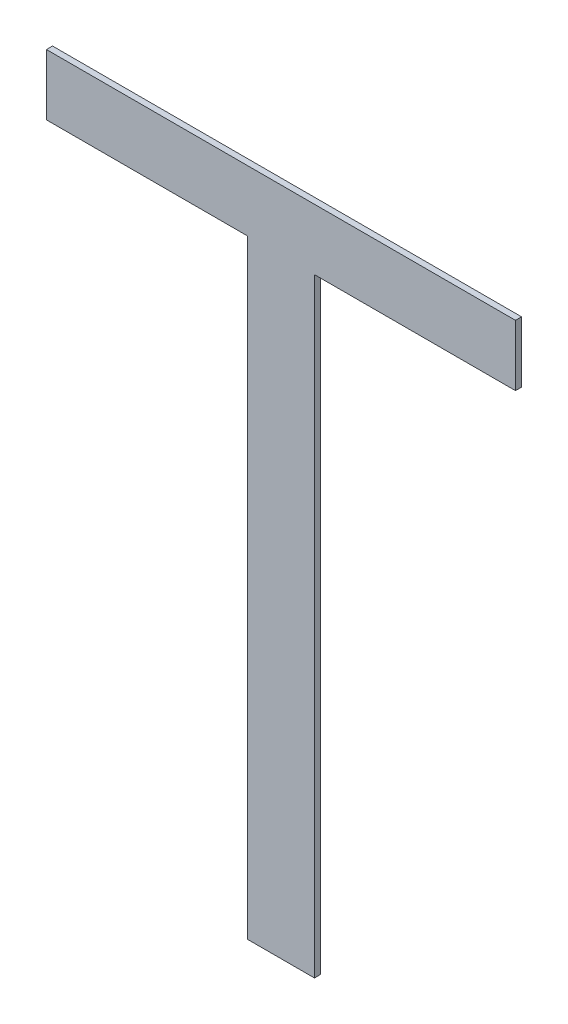
ISO-10303-21;
HEADER;
FILE_DESCRIPTION(('STEP AP214'),'2;1');
FILE_NAME('part.step','',(''),(''),'','','');
FILE_SCHEMA(('AUTOMOTIVE_DESIGN { 1 0 10303 214 1 1 1 1 }'));
ENDSEC;
DATA;
#1=APPLICATION_CONTEXT('core data for automotive mechanical design processes');
#2=APPLICATION_PROTOCOL_DEFINITION('international standard','automotive_design',2000,#1);
#3=PRODUCT_CONTEXT('',#1,'mechanical');
#4=PRODUCT('Part','Part','',(#3));
#5=PRODUCT_RELATED_PRODUCT_CATEGORY('part','',(#4));
#6=PRODUCT_DEFINITION_FORMATION('','',#4);
#7=PRODUCT_DEFINITION_CONTEXT('part definition',#1,'design');
#8=PRODUCT_DEFINITION('design','',#6,#7);
#9=PRODUCT_DEFINITION_SHAPE('','',#8);
#10=(LENGTH_UNIT() NAMED_UNIT(*) SI_UNIT(.MILLI.,.METRE.));
#11=(NAMED_UNIT(*) PLANE_ANGLE_UNIT() SI_UNIT($,.RADIAN.));
#12=(NAMED_UNIT(*) SI_UNIT($,.STERADIAN.) SOLID_ANGLE_UNIT());
#13=UNCERTAINTY_MEASURE_WITH_UNIT(LENGTH_MEASURE(1.E-05),#10,'distance_accuracy_value','');
#14=(GEOMETRIC_REPRESENTATION_CONTEXT(3) GLOBAL_UNCERTAINTY_ASSIGNED_CONTEXT((#13)) GLOBAL_UNIT_ASSIGNED_CONTEXT((#10,
#11,#12)) REPRESENTATION_CONTEXT('',''));
#15=CARTESIAN_POINT('',(0.,0.,0.));
#16=DIRECTION('',(0.,0.,1.));
#17=DIRECTION('',(1.,0.,0.));
#18=AXIS2_PLACEMENT_3D('',#15,#16,#17);
#19=CARTESIAN_POINT('',(-0.3850005,0.55000144,0.));
#20=DIRECTION('',(0.,0.,-1.));
#21=DIRECTION('',(-1.,0.,0.));
#22=AXIS2_PLACEMENT_3D('',#19,#20,#21);
#23=PLANE('',#22);
#24=DIRECTION('',(1.,0.,0.));
#25=VECTOR('',#24,1.);
#26=CARTESIAN_POINT('',(-0.05499862000001,-0.5499989,0.));
#27=LINE('',#26,#25);
#28=CARTESIAN_POINT('',(0.05500115999999,-0.5499989,0.));
#29=VERTEX_POINT('',#28);
#30=CARTESIAN_POINT('',(-0.05499862000001,-0.5499989,0.));
#31=VERTEX_POINT('',#30);
#32=EDGE_CURVE('E117',#29,#31,#27,.F.);
#33=ORIENTED_EDGE('',*,*,#32,.T.);
#34=DIRECTION('',(0.,1.,0.));
#35=VECTOR('',#34,1.);
#36=CARTESIAN_POINT('',(-0.05499862000001,0.45000164,0.));
#37=LINE('',#36,#35);
#38=CARTESIAN_POINT('',(-0.05499862000001,0.45000164,0.));
#39=VERTEX_POINT('',#38);
#40=EDGE_CURVE('E122',#31,#39,#37,.T.);
#41=ORIENTED_EDGE('',*,*,#40,.T.);
#42=DIRECTION('',(1.,0.,0.));
#43=VECTOR('',#42,1.);
#44=CARTESIAN_POINT('',(-0.3850005,0.45000164,0.));
#45=LINE('',#44,#43);
#46=CARTESIAN_POINT('',(-0.3850005,0.45000164,0.));
#47=VERTEX_POINT('',#46);
#48=EDGE_CURVE('E95',#39,#47,#45,.F.);
#49=ORIENTED_EDGE('',*,*,#48,.T.);
#50=DIRECTION('',(0.,1.,0.));
#51=VECTOR('',#50,1.);
#52=CARTESIAN_POINT('',(-0.3850005,0.55000144,0.));
#53=LINE('',#52,#51);
#54=CARTESIAN_POINT('',(-0.3850005,0.55000144,0.));
#55=VERTEX_POINT('',#54);
#56=EDGE_CURVE('E20',#47,#55,#53,.T.);
#57=ORIENTED_EDGE('',*,*,#56,.T.);
#58=DIRECTION('',(1.,0.,0.));
#59=VECTOR('',#58,1.);
#60=CARTESIAN_POINT('',(0.3850005,0.55000144,0.));
#61=LINE('',#60,#59);
#62=CARTESIAN_POINT('',(0.3850005,0.55000144,0.));
#63=VERTEX_POINT('',#62);
#64=EDGE_CURVE('E83',#55,#63,#61,.T.);
#65=ORIENTED_EDGE('',*,*,#64,.T.);
#66=DIRECTION('',(0.,1.,0.));
#67=VECTOR('',#66,1.);
#68=CARTESIAN_POINT('',(0.3850005,0.45000164,0.));
#69=LINE('',#68,#67);
#70=CARTESIAN_POINT('',(0.3850005,0.45000164,0.));
#71=VERTEX_POINT('',#70);
#72=EDGE_CURVE('E78',#63,#71,#69,.F.);
#73=ORIENTED_EDGE('',*,*,#72,.T.);
#74=DIRECTION('',(1.,0.,0.));
#75=VECTOR('',#74,1.);
#76=CARTESIAN_POINT('',(0.05500115999999,0.45000164,0.));
#77=LINE('',#76,#75);
#78=CARTESIAN_POINT('',(0.05500115999999,0.45000164,0.));
#79=VERTEX_POINT('',#78);
#80=EDGE_CURVE('E106',#71,#79,#77,.F.);
#81=ORIENTED_EDGE('',*,*,#80,.T.);
#82=DIRECTION('',(0.,1.,0.));
#83=VECTOR('',#82,1.);
#84=CARTESIAN_POINT('',(0.05500115999999,-0.5499989,0.));
#85=LINE('',#84,#83);
#86=EDGE_CURVE('E111',#79,#29,#85,.F.);
#87=ORIENTED_EDGE('',*,*,#86,.T.);
#88=EDGE_LOOP('',(#33,#41,#49,#57,#65,#73,#81,#87));
#89=FACE_BOUND('',#88,.T.);
#90=ADVANCED_FACE('F17',(#89),#23,.T.);
#91=CARTESIAN_POINT('',(-0.3850005,0.55000144,0.));
#92=DIRECTION('',(1.,0.,0.));
#93=DIRECTION('',(0.,0.,-1.));
#94=AXIS2_PLACEMENT_3D('',#91,#92,#93);
#95=PLANE('',#94);
#96=DIRECTION('',(0.,1.,0.));
#97=VECTOR('',#96,1.);
#98=CARTESIAN_POINT('',(-0.3850005,0.55000144,0.01));
#99=LINE('',#98,#97);
#100=CARTESIAN_POINT('',(-0.3850005,0.45000164,0.01));
#101=VERTEX_POINT('',#100);
#102=CARTESIAN_POINT('',(-0.3850005,0.55000144,0.01));
#103=VERTEX_POINT('',#102);
#104=EDGE_CURVE('E101',#101,#103,#99,.T.);
#105=ORIENTED_EDGE('',*,*,#104,.T.);
#106=DIRECTION('',(0.,0.,-1.));
#107=VECTOR('',#106,1.);
#108=CARTESIAN_POINT('',(-0.3850005,0.55000144,0.));
#109=LINE('',#108,#107);
#110=EDGE_CURVE('E88',#103,#55,#109,.T.);
#111=ORIENTED_EDGE('',*,*,#110,.T.);
#112=ORIENTED_EDGE('',*,*,#56,.F.);
#113=DIRECTION('',(0.,0.,1.));
#114=VECTOR('',#113,1.);
#115=CARTESIAN_POINT('',(-0.3850005,0.45000164,0.));
#116=LINE('',#115,#114);
#117=EDGE_CURVE('E128',#47,#101,#116,.T.);
#118=ORIENTED_EDGE('',*,*,#117,.T.);
#119=EDGE_LOOP('',(#105,#111,#112,#118));
#120=FACE_BOUND('',#119,.T.);
#121=ADVANCED_FACE('F100',(#120),#95,.F.);
#122=CARTESIAN_POINT('',(0.3850005,0.55000144,0.));
#123=DIRECTION('',(0.,-1.,0.));
#124=DIRECTION('',(0.,0.,-1.));
#125=AXIS2_PLACEMENT_3D('',#122,#123,#124);
#126=PLANE('',#125);
#127=DIRECTION('',(-1.,0.,0.));
#128=VECTOR('',#127,1.);
#129=CARTESIAN_POINT('',(-0.3850005,0.55000144,0.01));
#130=LINE('',#129,#128);
#131=CARTESIAN_POINT('',(0.3850005,0.55000144,0.01));
#132=VERTEX_POINT('',#131);
#133=EDGE_CURVE('E132',#103,#132,#130,.F.);
#134=ORIENTED_EDGE('',*,*,#133,.T.);
#135=DIRECTION('',(0.,0.,1.));
#136=VECTOR('',#135,1.);
#137=CARTESIAN_POINT('',(0.3850005,0.55000144,0.));
#138=LINE('',#137,#136);
#139=EDGE_CURVE('E90',#132,#63,#138,.F.);
#140=ORIENTED_EDGE('',*,*,#139,.T.);
#141=ORIENTED_EDGE('',*,*,#64,.F.);
#142=ORIENTED_EDGE('',*,*,#110,.F.);
#143=EDGE_LOOP('',(#134,#140,#141,#142));
#144=FACE_BOUND('',#143,.T.);
#145=ADVANCED_FACE('F86',(#144),#126,.F.);
#146=CARTESIAN_POINT('',(0.3850005,0.45000164,0.));
#147=DIRECTION('',(-1.,0.,0.));
#148=DIRECTION('',(0.,0.,1.));
#149=AXIS2_PLACEMENT_3D('',#146,#147,#148);
#150=PLANE('',#149);
#151=DIRECTION('',(0.,1.,0.));
#152=VECTOR('',#151,1.);
#153=CARTESIAN_POINT('',(0.3850005,0.55000144,0.01));
#154=LINE('',#153,#152);
#155=CARTESIAN_POINT('',(0.3850005,0.45000164,0.01));
#156=VERTEX_POINT('',#155);
#157=EDGE_CURVE('E134',#132,#156,#154,.F.);
#158=ORIENTED_EDGE('',*,*,#157,.T.);
#159=DIRECTION('',(0.,0.,1.));
#160=VECTOR('',#159,1.);
#161=CARTESIAN_POINT('',(0.3850005,0.45000164,0.));
#162=LINE('',#161,#160);
#163=EDGE_CURVE('E109',#156,#71,#162,.F.);
#164=ORIENTED_EDGE('',*,*,#163,.T.);
#165=ORIENTED_EDGE('',*,*,#72,.F.);
#166=ORIENTED_EDGE('',*,*,#139,.F.);
#167=EDGE_LOOP('',(#158,#164,#165,#166));
#168=FACE_BOUND('',#167,.T.);
#169=ADVANCED_FACE('F162',(#168),#150,.F.);
#170=CARTESIAN_POINT('',(0.05500115999999,0.45000164,0.));
#171=DIRECTION('',(0.,1.,0.));
#172=DIRECTION('',(0.,0.,1.));
#173=AXIS2_PLACEMENT_3D('',#170,#171,#172);
#174=PLANE('',#173);
#175=DIRECTION('',(-1.,0.,0.));
#176=VECTOR('',#175,1.);
#177=CARTESIAN_POINT('',(-0.3850005,0.45000164,0.01));
#178=LINE('',#177,#176);
#179=CARTESIAN_POINT('',(0.05500115999999,0.45000164,0.01));
#180=VERTEX_POINT('',#179);
#181=EDGE_CURVE('E137',#156,#180,#178,.T.);
#182=ORIENTED_EDGE('',*,*,#181,.T.);
#183=DIRECTION('',(0.,0.,1.));
#184=VECTOR('',#183,1.);
#185=CARTESIAN_POINT('',(0.05500115999999,0.45000164,0.));
#186=LINE('',#185,#184);
#187=EDGE_CURVE('E114',#180,#79,#186,.F.);
#188=ORIENTED_EDGE('',*,*,#187,.T.);
#189=ORIENTED_EDGE('',*,*,#80,.F.);
#190=ORIENTED_EDGE('',*,*,#163,.F.);
#191=EDGE_LOOP('',(#182,#188,#189,#190));
#192=FACE_BOUND('',#191,.T.);
#193=ADVANCED_FACE('F161',(#192),#174,.F.);
#194=CARTESIAN_POINT('',(0.05500115999999,-0.5499989,0.));
#195=DIRECTION('',(-1.,0.,0.));
#196=DIRECTION('',(0.,0.,1.));
#197=AXIS2_PLACEMENT_3D('',#194,#195,#196);
#198=PLANE('',#197);
#199=DIRECTION('',(0.,1.,0.));
#200=VECTOR('',#199,1.);
#201=CARTESIAN_POINT('',(0.05500115999999,0.55000144,0.01));
#202=LINE('',#201,#200);
#203=CARTESIAN_POINT('',(0.05500115999999,-0.5499989,0.01));
#204=VERTEX_POINT('',#203);
#205=EDGE_CURVE('E140',#180,#204,#202,.F.);
#206=ORIENTED_EDGE('',*,*,#205,.T.);
#207=DIRECTION('',(0.,0.,1.));
#208=VECTOR('',#207,1.);
#209=CARTESIAN_POINT('',(0.05500115999999,-0.5499989,0.));
#210=LINE('',#209,#208);
#211=EDGE_CURVE('E119',#204,#29,#210,.F.);
#212=ORIENTED_EDGE('',*,*,#211,.T.);
#213=ORIENTED_EDGE('',*,*,#86,.F.);
#214=ORIENTED_EDGE('',*,*,#187,.F.);
#215=EDGE_LOOP('',(#206,#212,#213,#214));
#216=FACE_BOUND('',#215,.T.);
#217=ADVANCED_FACE('F157',(#216),#198,.F.);
#218=CARTESIAN_POINT('',(-0.05499862000001,-0.5499989,0.));
#219=DIRECTION('',(0.,1.,0.));
#220=DIRECTION('',(0.,0.,1.));
#221=AXIS2_PLACEMENT_3D('',#218,#219,#220);
#222=PLANE('',#221);
#223=DIRECTION('',(-1.,0.,0.));
#224=VECTOR('',#223,1.);
#225=CARTESIAN_POINT('',(-0.3850005,-0.5499989,0.01));
#226=LINE('',#225,#224);
#227=CARTESIAN_POINT('',(-0.05499862000001,-0.5499989,0.01));
#228=VERTEX_POINT('',#227);
#229=EDGE_CURVE('E143',#204,#228,#226,.T.);
#230=ORIENTED_EDGE('',*,*,#229,.T.);
#231=DIRECTION('',(0.,0.,-1.));
#232=VECTOR('',#231,1.);
#233=CARTESIAN_POINT('',(-0.05499862000001,-0.5499989,0.));
#234=LINE('',#233,#232);
#235=EDGE_CURVE('E124',#228,#31,#234,.T.);
#236=ORIENTED_EDGE('',*,*,#235,.T.);
#237=ORIENTED_EDGE('',*,*,#32,.F.);
#238=ORIENTED_EDGE('',*,*,#211,.F.);
#239=EDGE_LOOP('',(#230,#236,#237,#238));
#240=FACE_BOUND('',#239,.T.);
#241=ADVANCED_FACE('F155',(#240),#222,.F.);
#242=CARTESIAN_POINT('',(-0.05499862000001,0.45000164,0.));
#243=DIRECTION('',(1.,0.,0.));
#244=DIRECTION('',(0.,0.,-1.));
#245=AXIS2_PLACEMENT_3D('',#242,#243,#244);
#246=PLANE('',#245);
#247=DIRECTION('',(0.,1.,0.));
#248=VECTOR('',#247,1.);
#249=CARTESIAN_POINT('',(-0.05499862000001,0.55000144,0.01));
#250=LINE('',#249,#248);
#251=CARTESIAN_POINT('',(-0.05499862000001,0.45000164,0.01));
#252=VERTEX_POINT('',#251);
#253=EDGE_CURVE('E26',#228,#252,#250,.T.);
#254=ORIENTED_EDGE('',*,*,#253,.T.);
#255=DIRECTION('',(0.,0.,1.));
#256=VECTOR('',#255,1.);
#257=CARTESIAN_POINT('',(-0.05499862000001,0.45000164,0.));
#258=LINE('',#257,#256);
#259=EDGE_CURVE('E34',#252,#39,#258,.F.);
#260=ORIENTED_EDGE('',*,*,#259,.T.);
#261=ORIENTED_EDGE('',*,*,#40,.F.);
#262=ORIENTED_EDGE('',*,*,#235,.F.);
#263=EDGE_LOOP('',(#254,#260,#261,#262));
#264=FACE_BOUND('',#263,.T.);
#265=ADVANCED_FACE('F149',(#264),#246,.F.);
#266=CARTESIAN_POINT('',(-0.3850005,0.45000164,0.));
#267=DIRECTION('',(0.,1.,0.));
#268=DIRECTION('',(0.,0.,1.));
#269=AXIS2_PLACEMENT_3D('',#266,#267,#268);
#270=PLANE('',#269);
#271=DIRECTION('',(-1.,0.,0.));
#272=VECTOR('',#271,1.);
#273=CARTESIAN_POINT('',(-0.3850005,0.45000164,0.01));
#274=LINE('',#273,#272);
#275=EDGE_CURVE('E11',#252,#101,#274,.T.);
#276=ORIENTED_EDGE('',*,*,#275,.T.);
#277=ORIENTED_EDGE('',*,*,#117,.F.);
#278=ORIENTED_EDGE('',*,*,#48,.F.);
#279=ORIENTED_EDGE('',*,*,#259,.F.);
#280=EDGE_LOOP('',(#276,#277,#278,#279));
#281=FACE_BOUND('',#280,.T.);
#282=ADVANCED_FACE('F163',(#281),#270,.F.);
#283=CARTESIAN_POINT('',(-0.3850005,0.55000144,0.01));
#284=DIRECTION('',(0.,0.,-1.));
#285=DIRECTION('',(-1.,0.,0.));
#286=AXIS2_PLACEMENT_3D('',#283,#284,#285);
#287=PLANE('',#286);
#288=ORIENTED_EDGE('',*,*,#253,.F.);
#289=ORIENTED_EDGE('',*,*,#229,.F.);
#290=ORIENTED_EDGE('',*,*,#205,.F.);
#291=ORIENTED_EDGE('',*,*,#181,.F.);
#292=ORIENTED_EDGE('',*,*,#157,.F.);
#293=ORIENTED_EDGE('',*,*,#133,.F.);
#294=ORIENTED_EDGE('',*,*,#104,.F.);
#295=ORIENTED_EDGE('',*,*,#275,.F.);
#296=EDGE_LOOP('',(#288,#289,#290,#291,#292,#293,#294,#295));
#297=FACE_BOUND('',#296,.T.);
#298=ADVANCED_FACE('F152',(#297),#287,.F.);
#299=CLOSED_SHELL('',(#90,#121,#145,#169,#193,#217,#241,#265,#282,#298));
#300=MANIFOLD_SOLID_BREP('B1',#299);
#301=ADVANCED_BREP_SHAPE_REPRESENTATION('',(#18,#300),#14);
#302=SHAPE_DEFINITION_REPRESENTATION(#9,#301);
ENDSEC;
END-ISO-10303-21;
